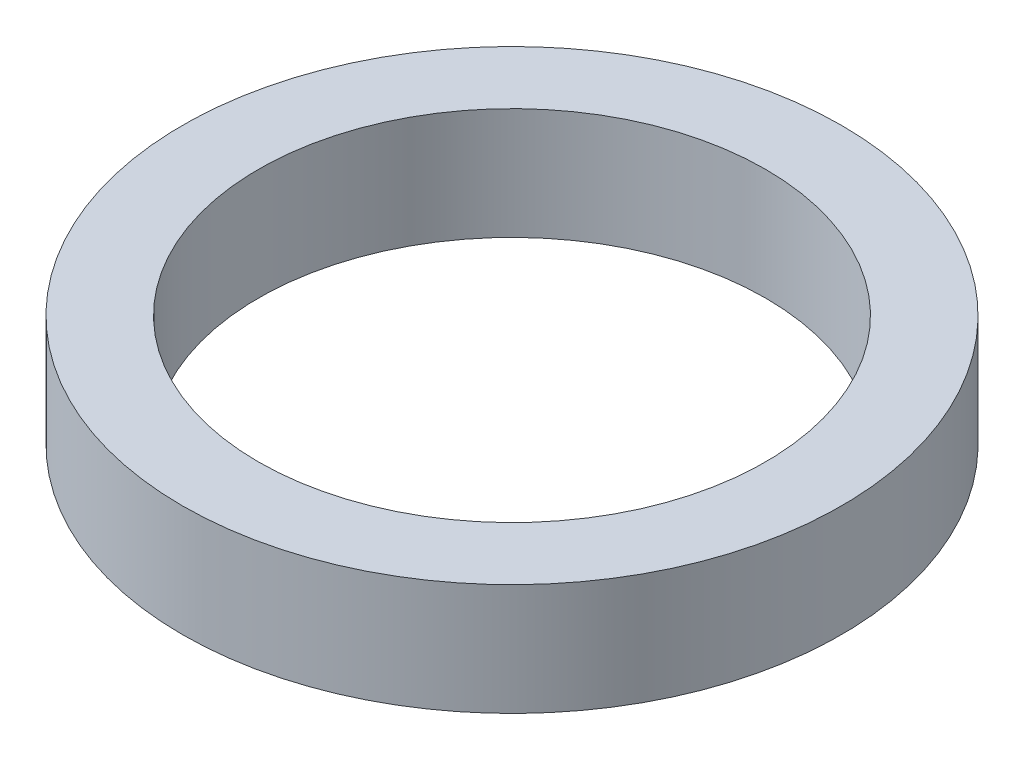
ISO-10303-21;
HEADER;
FILE_DESCRIPTION(('STEP AP214'),'2;1');
FILE_NAME('part.step','',(''),(''),'','','');
FILE_SCHEMA(('AUTOMOTIVE_DESIGN { 1 0 10303 214 1 1 1 1 }'));
ENDSEC;
DATA;
#1=APPLICATION_CONTEXT('core data for automotive mechanical design processes');
#2=APPLICATION_PROTOCOL_DEFINITION('international standard','automotive_design',2000,#1);
#3=PRODUCT_CONTEXT('',#1,'mechanical');
#4=PRODUCT('Part','Part','',(#3));
#5=PRODUCT_RELATED_PRODUCT_CATEGORY('part','',(#4));
#6=PRODUCT_DEFINITION_FORMATION('','',#4);
#7=PRODUCT_DEFINITION_CONTEXT('part definition',#1,'design');
#8=PRODUCT_DEFINITION('design','',#6,#7);
#9=PRODUCT_DEFINITION_SHAPE('','',#8);
#10=(LENGTH_UNIT() NAMED_UNIT(*) SI_UNIT(.MILLI.,.METRE.));
#11=(NAMED_UNIT(*) PLANE_ANGLE_UNIT() SI_UNIT($,.RADIAN.));
#12=(NAMED_UNIT(*) SI_UNIT($,.STERADIAN.) SOLID_ANGLE_UNIT());
#13=UNCERTAINTY_MEASURE_WITH_UNIT(LENGTH_MEASURE(1.E-05),#10,'distance_accuracy_value','');
#14=(GEOMETRIC_REPRESENTATION_CONTEXT(3) GLOBAL_UNCERTAINTY_ASSIGNED_CONTEXT((#13)) GLOBAL_UNIT_ASSIGNED_CONTEXT((#10,
#11,#12)) REPRESENTATION_CONTEXT('',''));
#15=CARTESIAN_POINT('',(0.,0.,0.));
#16=DIRECTION('',(0.,0.,1.));
#17=DIRECTION('',(1.,0.,0.));
#18=AXIS2_PLACEMENT_3D('',#15,#16,#17);
#19=CARTESIAN_POINT('',(0.,22.,0.));
#20=DIRECTION('',(0.,-1.,0.));
#21=DIRECTION('',(0.,0.,-1.));
#22=AXIS2_PLACEMENT_3D('',#19,#20,#21);
#23=CYLINDRICAL_SURFACE('',#22,65.);
#24=CARTESIAN_POINT('',(0.,22.,0.));
#25=DIRECTION('',(0.,1.,0.));
#26=DIRECTION('',(0.,0.,1.));
#27=AXIS2_PLACEMENT_3D('',#24,#25,#26);
#28=CIRCLE('',#27,65.);
#29=CARTESIAN_POINT('',(0.,22.,65.));
#30=VERTEX_POINT('',#29);
#31=EDGE_CURVE('E10',#30,#30,#28,.T.);
#32=ORIENTED_EDGE('',*,*,#31,.F.);
#33=EDGE_LOOP('',(#32));
#34=FACE_BOUND('',#33,.T.);
#35=CARTESIAN_POINT('',(0.,0.,0.));
#36=DIRECTION('',(0.,1.,0.));
#37=DIRECTION('',(0.,0.,1.));
#38=AXIS2_PLACEMENT_3D('',#35,#36,#37);
#39=CIRCLE('',#38,65.);
#40=CARTESIAN_POINT('',(0.,0.,65.));
#41=VERTEX_POINT('',#40);
#42=EDGE_CURVE('E37',#41,#41,#39,.T.);
#43=ORIENTED_EDGE('',*,*,#42,.T.);
#44=EDGE_LOOP('',(#43));
#45=FACE_BOUND('',#44,.T.);
#46=ADVANCED_FACE('F40',(#34,#45),#23,.T.);
#47=CARTESIAN_POINT('',(0.,22.,0.));
#48=DIRECTION('',(0.,1.,0.));
#49=DIRECTION('',(0.,0.,1.));
#50=AXIS2_PLACEMENT_3D('',#47,#48,#49);
#51=PLANE('',#50);
#52=CARTESIAN_POINT('',(0.,22.,0.));
#53=DIRECTION('',(0.,1.,0.));
#54=DIRECTION('',(0.,0.,1.));
#55=AXIS2_PLACEMENT_3D('',#52,#53,#54);
#56=CIRCLE('',#55,50.);
#57=CARTESIAN_POINT('',(0.,22.,50.));
#58=VERTEX_POINT('',#57);
#59=EDGE_CURVE('E50',#58,#58,#56,.T.);
#60=ORIENTED_EDGE('',*,*,#59,.F.);
#61=EDGE_LOOP('',(#60));
#62=FACE_BOUND('',#61,.T.);
#63=ORIENTED_EDGE('',*,*,#31,.T.);
#64=EDGE_LOOP('',(#63));
#65=FACE_BOUND('',#64,.T.);
#66=ADVANCED_FACE('F59',(#62,#65),#51,.T.);
#67=CARTESIAN_POINT('',(0.,0.,0.));
#68=DIRECTION('',(0.,1.,0.));
#69=DIRECTION('',(0.,0.,1.));
#70=AXIS2_PLACEMENT_3D('',#67,#68,#69);
#71=PLANE('',#70);
#72=CARTESIAN_POINT('',(0.,0.,0.));
#73=DIRECTION('',(0.,1.,0.));
#74=DIRECTION('',(0.,0.,1.));
#75=AXIS2_PLACEMENT_3D('',#72,#73,#74);
#76=CIRCLE('',#75,50.);
#77=CARTESIAN_POINT('',(0.,0.,50.));
#78=VERTEX_POINT('',#77);
#79=EDGE_CURVE('E47',#78,#78,#76,.T.);
#80=ORIENTED_EDGE('',*,*,#79,.T.);
#81=EDGE_LOOP('',(#80));
#82=FACE_BOUND('',#81,.T.);
#83=ORIENTED_EDGE('',*,*,#42,.F.);
#84=EDGE_LOOP('',(#83));
#85=FACE_BOUND('',#84,.T.);
#86=ADVANCED_FACE('F58',(#82,#85),#71,.F.);
#87=CARTESIAN_POINT('',(0.,22.,0.));
#88=DIRECTION('',(0.,-1.,0.));
#89=DIRECTION('',(0.,0.,-1.));
#90=AXIS2_PLACEMENT_3D('',#87,#88,#89);
#91=CYLINDRICAL_SURFACE('',#90,50.);
#92=ORIENTED_EDGE('',*,*,#59,.T.);
#93=EDGE_LOOP('',(#92));
#94=FACE_BOUND('',#93,.T.);
#95=ORIENTED_EDGE('',*,*,#79,.F.);
#96=EDGE_LOOP('',(#95));
#97=FACE_BOUND('',#96,.T.);
#98=ADVANCED_FACE('F54',(#94,#97),#91,.F.);
#99=CLOSED_SHELL('',(#46,#66,#86,#98));
#100=MANIFOLD_SOLID_BREP('B2',#99);
#101=ADVANCED_BREP_SHAPE_REPRESENTATION('',(#18,#100),#14);
#102=SHAPE_DEFINITION_REPRESENTATION(#9,#101);
ENDSEC;
END-ISO-10303-21;
